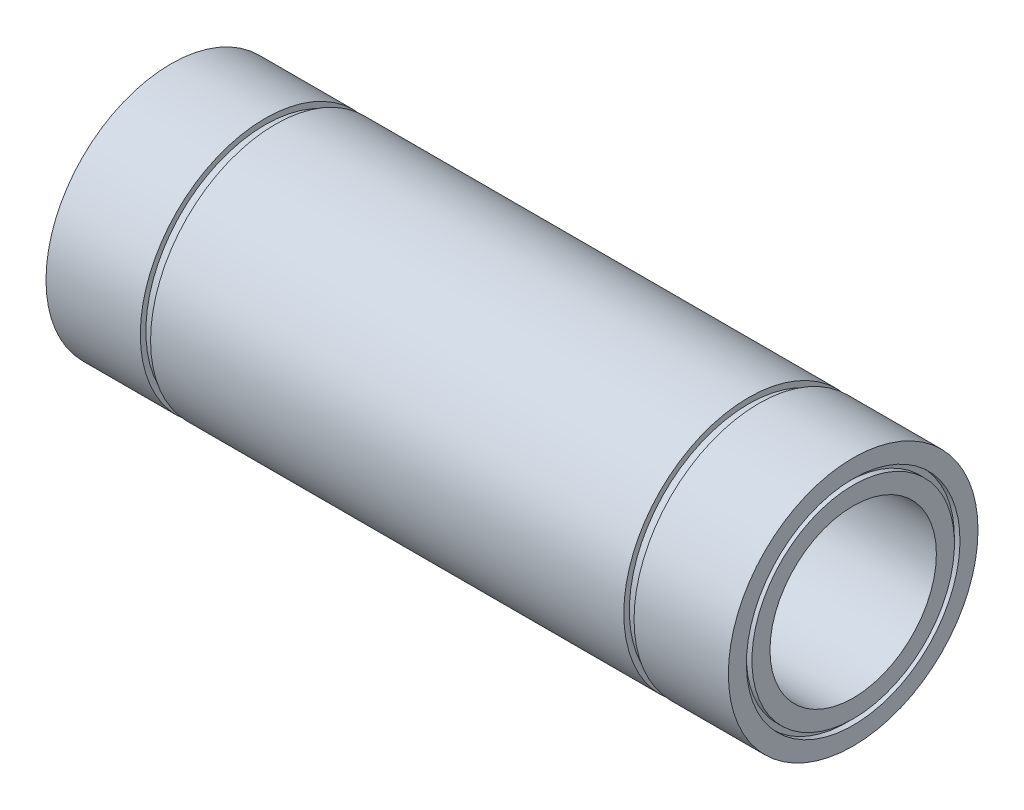
ISO-10303-21;
HEADER;
FILE_DESCRIPTION(('STEP AP214'),'2;1');
FILE_NAME('part.step','',(''),(''),'','','');
FILE_SCHEMA(('AUTOMOTIVE_DESIGN { 1 0 10303 214 1 1 1 1 }'));
ENDSEC;
DATA;
#1=APPLICATION_CONTEXT('core data for automotive mechanical design processes');
#2=APPLICATION_PROTOCOL_DEFINITION('international standard','automotive_design',2000,#1);
#3=PRODUCT_CONTEXT('',#1,'mechanical');
#4=PRODUCT('Part','Part','',(#3));
#5=PRODUCT_RELATED_PRODUCT_CATEGORY('part','',(#4));
#6=PRODUCT_DEFINITION_FORMATION('','',#4);
#7=PRODUCT_DEFINITION_CONTEXT('part definition',#1,'design');
#8=PRODUCT_DEFINITION('design','',#6,#7);
#9=PRODUCT_DEFINITION_SHAPE('','',#8);
#10=(LENGTH_UNIT() NAMED_UNIT(*) SI_UNIT(.MILLI.,.METRE.));
#11=(NAMED_UNIT(*) PLANE_ANGLE_UNIT() SI_UNIT($,.RADIAN.));
#12=(NAMED_UNIT(*) SI_UNIT($,.STERADIAN.) SOLID_ANGLE_UNIT());
#13=UNCERTAINTY_MEASURE_WITH_UNIT(LENGTH_MEASURE(1.E-05),#10,'distance_accuracy_value','');
#14=(GEOMETRIC_REPRESENTATION_CONTEXT(3) GLOBAL_UNCERTAINTY_ASSIGNED_CONTEXT((#13)) GLOBAL_UNIT_ASSIGNED_CONTEXT((#10,
#11,#12)) REPRESENTATION_CONTEXT('',''));
#15=CARTESIAN_POINT('',(0.,0.,0.));
#16=DIRECTION('',(0.,0.,1.));
#17=DIRECTION('',(1.,0.,0.));
#18=AXIS2_PLACEMENT_3D('',#15,#16,#17);
#19=CARTESIAN_POINT('',(-61.5,19.25,0.));
#20=DIRECTION('',(-1.,0.,0.));
#21=DIRECTION('',(0.,-1.,0.));
#22=AXIS2_PLACEMENT_3D('',#19,#20,#21);
#23=PLANE('',#22);
#24=CARTESIAN_POINT('',(-61.5,0.,0.));
#25=DIRECTION('',(1.,0.,0.));
#26=DIRECTION('',(0.,1.,0.));
#27=AXIS2_PLACEMENT_3D('',#24,#25,#26);
#28=CIRCLE('',#27,19.25);
#29=CARTESIAN_POINT('',(-61.5,19.25,0.));
#30=VERTEX_POINT('',#29);
#31=EDGE_CURVE('E123',#30,#30,#28,.T.);
#32=ORIENTED_EDGE('',*,*,#31,.T.);
#33=EDGE_LOOP('',(#32));
#34=FACE_BOUND('',#33,.T.);
#35=CARTESIAN_POINT('',(-61.5,0.,0.));
#36=DIRECTION('',(1.,0.,0.));
#37=DIRECTION('',(0.,1.,0.));
#38=AXIS2_PLACEMENT_3D('',#35,#36,#37);
#39=CIRCLE('',#38,22.5);
#40=CARTESIAN_POINT('',(-61.5,22.5,0.));
#41=VERTEX_POINT('',#40);
#42=EDGE_CURVE('E10',#41,#41,#39,.T.);
#43=ORIENTED_EDGE('',*,*,#42,.F.);
#44=EDGE_LOOP('',(#43));
#45=FACE_BOUND('',#44,.T.);
#46=ADVANCED_FACE('F40',(#34,#45),#23,.T.);
#47=CARTESIAN_POINT('',(0.,0.,0.));
#48=DIRECTION('',(1.,0.,0.));
#49=DIRECTION('',(0.,1.,0.));
#50=AXIS2_PLACEMENT_3D('',#47,#48,#49);
#51=CYLINDRICAL_SURFACE('',#50,22.5);
#52=ORIENTED_EDGE('',*,*,#42,.T.);
#53=EDGE_LOOP('',(#52));
#54=FACE_BOUND('',#53,.T.);
#55=CARTESIAN_POINT('',(-44.5,0.,0.));
#56=DIRECTION('',(1.,0.,0.));
#57=DIRECTION('',(0.,1.,0.));
#58=AXIS2_PLACEMENT_3D('',#55,#56,#57);
#59=CIRCLE('',#58,22.5);
#60=CARTESIAN_POINT('',(-44.5,22.5,0.));
#61=VERTEX_POINT('',#60);
#62=EDGE_CURVE('E47',#61,#61,#59,.T.);
#63=ORIENTED_EDGE('',*,*,#62,.F.);
#64=EDGE_LOOP('',(#63));
#65=FACE_BOUND('',#64,.T.);
#66=ADVANCED_FACE('F142',(#54,#65),#51,.T.);
#67=CARTESIAN_POINT('',(-44.5,22.5,0.));
#68=DIRECTION('',(1.,0.,0.));
#69=DIRECTION('',(0.,1.,0.));
#70=AXIS2_PLACEMENT_3D('',#67,#68,#69);
#71=PLANE('',#70);
#72=ORIENTED_EDGE('',*,*,#62,.T.);
#73=EDGE_LOOP('',(#72));
#74=FACE_BOUND('',#73,.T.);
#75=CARTESIAN_POINT('',(-44.5,0.,0.));
#76=DIRECTION('',(1.,0.,0.));
#77=DIRECTION('',(0.,1.,0.));
#78=AXIS2_PLACEMENT_3D('',#75,#76,#77);
#79=CIRCLE('',#78,21.5);
#80=CARTESIAN_POINT('',(-44.5,21.5,0.));
#81=VERTEX_POINT('',#80);
#82=EDGE_CURVE('E54',#81,#81,#79,.T.);
#83=ORIENTED_EDGE('',*,*,#82,.F.);
#84=EDGE_LOOP('',(#83));
#85=FACE_BOUND('',#84,.T.);
#86=ADVANCED_FACE('F146',(#74,#85),#71,.T.);
#87=CARTESIAN_POINT('',(0.,0.,0.));
#88=DIRECTION('',(1.,0.,0.));
#89=DIRECTION('',(0.,1.,0.));
#90=AXIS2_PLACEMENT_3D('',#87,#88,#89);
#91=CYLINDRICAL_SURFACE('',#90,21.5);
#92=ORIENTED_EDGE('',*,*,#82,.T.);
#93=EDGE_LOOP('',(#92));
#94=FACE_BOUND('',#93,.T.);
#95=CARTESIAN_POINT('',(-42.65,0.,0.));
#96=DIRECTION('',(1.,0.,0.));
#97=DIRECTION('',(0.,1.,0.));
#98=AXIS2_PLACEMENT_3D('',#95,#96,#97);
#99=CIRCLE('',#98,21.5);
#100=CARTESIAN_POINT('',(-42.65,21.5,0.));
#101=VERTEX_POINT('',#100);
#102=EDGE_CURVE('E60',#101,#101,#99,.T.);
#103=ORIENTED_EDGE('',*,*,#102,.F.);
#104=EDGE_LOOP('',(#103));
#105=FACE_BOUND('',#104,.T.);
#106=ADVANCED_FACE('F150',(#94,#105),#91,.T.);
#107=CARTESIAN_POINT('',(-42.65,21.5,0.));
#108=DIRECTION('',(-1.,0.,0.));
#109=DIRECTION('',(0.,-1.,0.));
#110=AXIS2_PLACEMENT_3D('',#107,#108,#109);
#111=PLANE('',#110);
#112=ORIENTED_EDGE('',*,*,#102,.T.);
#113=EDGE_LOOP('',(#112));
#114=FACE_BOUND('',#113,.T.);
#115=CARTESIAN_POINT('',(-42.65,0.,0.));
#116=DIRECTION('',(1.,0.,0.));
#117=DIRECTION('',(0.,1.,0.));
#118=AXIS2_PLACEMENT_3D('',#115,#116,#117);
#119=CIRCLE('',#118,22.5);
#120=CARTESIAN_POINT('',(-42.65,22.5,0.));
#121=VERTEX_POINT('',#120);
#122=EDGE_CURVE('E66',#121,#121,#119,.T.);
#123=ORIENTED_EDGE('',*,*,#122,.F.);
#124=EDGE_LOOP('',(#123));
#125=FACE_BOUND('',#124,.T.);
#126=ADVANCED_FACE('F156',(#114,#125),#111,.T.);
#127=CARTESIAN_POINT('',(0.,0.,0.));
#128=DIRECTION('',(1.,0.,0.));
#129=DIRECTION('',(0.,1.,0.));
#130=AXIS2_PLACEMENT_3D('',#127,#128,#129);
#131=CYLINDRICAL_SURFACE('',#130,22.5);
#132=ORIENTED_EDGE('',*,*,#122,.T.);
#133=EDGE_LOOP('',(#132));
#134=FACE_BOUND('',#133,.T.);
#135=CARTESIAN_POINT('',(42.65,0.,0.));
#136=DIRECTION('',(1.,0.,0.));
#137=DIRECTION('',(0.,1.,0.));
#138=AXIS2_PLACEMENT_3D('',#135,#136,#137);
#139=CIRCLE('',#138,22.5);
#140=CARTESIAN_POINT('',(42.65,22.5,0.));
#141=VERTEX_POINT('',#140);
#142=EDGE_CURVE('E70',#141,#141,#139,.T.);
#143=ORIENTED_EDGE('',*,*,#142,.F.);
#144=EDGE_LOOP('',(#143));
#145=FACE_BOUND('',#144,.T.);
#146=ADVANCED_FACE('F160',(#134,#145),#131,.T.);
#147=CARTESIAN_POINT('',(42.65,22.5,0.));
#148=DIRECTION('',(1.,0.,0.));
#149=DIRECTION('',(0.,1.,0.));
#150=AXIS2_PLACEMENT_3D('',#147,#148,#149);
#151=PLANE('',#150);
#152=ORIENTED_EDGE('',*,*,#142,.T.);
#153=EDGE_LOOP('',(#152));
#154=FACE_BOUND('',#153,.T.);
#155=CARTESIAN_POINT('',(42.65,0.,0.));
#156=DIRECTION('',(1.,0.,0.));
#157=DIRECTION('',(0.,1.,0.));
#158=AXIS2_PLACEMENT_3D('',#155,#156,#157);
#159=CIRCLE('',#158,21.5);
#160=CARTESIAN_POINT('',(42.65,21.5,0.));
#161=VERTEX_POINT('',#160);
#162=EDGE_CURVE('E74',#161,#161,#159,.T.);
#163=ORIENTED_EDGE('',*,*,#162,.F.);
#164=EDGE_LOOP('',(#163));
#165=FACE_BOUND('',#164,.T.);
#166=ADVANCED_FACE('F164',(#154,#165),#151,.T.);
#167=CARTESIAN_POINT('',(0.,0.,0.));
#168=DIRECTION('',(1.,0.,0.));
#169=DIRECTION('',(0.,1.,0.));
#170=AXIS2_PLACEMENT_3D('',#167,#168,#169);
#171=CYLINDRICAL_SURFACE('',#170,21.5);
#172=ORIENTED_EDGE('',*,*,#162,.T.);
#173=EDGE_LOOP('',(#172));
#174=FACE_BOUND('',#173,.T.);
#175=CARTESIAN_POINT('',(44.5,0.,0.));
#176=DIRECTION('',(1.,0.,0.));
#177=DIRECTION('',(0.,1.,0.));
#178=AXIS2_PLACEMENT_3D('',#175,#176,#177);
#179=CIRCLE('',#178,21.5);
#180=CARTESIAN_POINT('',(44.5,21.5,0.));
#181=VERTEX_POINT('',#180);
#182=EDGE_CURVE('E77',#181,#181,#179,.T.);
#183=ORIENTED_EDGE('',*,*,#182,.F.);
#184=EDGE_LOOP('',(#183));
#185=FACE_BOUND('',#184,.T.);
#186=ADVANCED_FACE('F168',(#174,#185),#171,.T.);
#187=CARTESIAN_POINT('',(44.5,21.5,0.));
#188=DIRECTION('',(-1.,0.,0.));
#189=DIRECTION('',(0.,-1.,0.));
#190=AXIS2_PLACEMENT_3D('',#187,#188,#189);
#191=PLANE('',#190);
#192=ORIENTED_EDGE('',*,*,#182,.T.);
#193=EDGE_LOOP('',(#192));
#194=FACE_BOUND('',#193,.T.);
#195=CARTESIAN_POINT('',(44.5,0.,0.));
#196=DIRECTION('',(1.,0.,0.));
#197=DIRECTION('',(0.,1.,0.));
#198=AXIS2_PLACEMENT_3D('',#195,#196,#197);
#199=CIRCLE('',#198,22.5);
#200=CARTESIAN_POINT('',(44.5,22.5,0.));
#201=VERTEX_POINT('',#200);
#202=EDGE_CURVE('E81',#201,#201,#199,.T.);
#203=ORIENTED_EDGE('',*,*,#202,.F.);
#204=EDGE_LOOP('',(#203));
#205=FACE_BOUND('',#204,.T.);
#206=ADVANCED_FACE('F172',(#194,#205),#191,.T.);
#207=CARTESIAN_POINT('',(0.,0.,0.));
#208=DIRECTION('',(1.,0.,0.));
#209=DIRECTION('',(0.,1.,0.));
#210=AXIS2_PLACEMENT_3D('',#207,#208,#209);
#211=CYLINDRICAL_SURFACE('',#210,22.5);
#212=ORIENTED_EDGE('',*,*,#202,.T.);
#213=EDGE_LOOP('',(#212));
#214=FACE_BOUND('',#213,.T.);
#215=CARTESIAN_POINT('',(61.5,0.,0.));
#216=DIRECTION('',(1.,0.,0.));
#217=DIRECTION('',(0.,1.,0.));
#218=AXIS2_PLACEMENT_3D('',#215,#216,#217);
#219=CIRCLE('',#218,22.4999999999999);
#220=CARTESIAN_POINT('',(61.5,22.4999999999999,0.));
#221=VERTEX_POINT('',#220);
#222=EDGE_CURVE('E85',#221,#221,#219,.T.);
#223=ORIENTED_EDGE('',*,*,#222,.F.);
#224=EDGE_LOOP('',(#223));
#225=FACE_BOUND('',#224,.T.);
#226=ADVANCED_FACE('F176',(#214,#225),#211,.T.);
#227=CARTESIAN_POINT('',(61.5,22.4999999999999,0.));
#228=DIRECTION('',(1.,0.,0.));
#229=DIRECTION('',(0.,1.,0.));
#230=AXIS2_PLACEMENT_3D('',#227,#228,#229);
#231=PLANE('',#230);
#232=ORIENTED_EDGE('',*,*,#222,.T.);
#233=EDGE_LOOP('',(#232));
#234=FACE_BOUND('',#233,.T.);
#235=CARTESIAN_POINT('',(61.5,0.,0.));
#236=DIRECTION('',(1.,0.,0.));
#237=DIRECTION('',(0.,1.,0.));
#238=AXIS2_PLACEMENT_3D('',#235,#236,#237);
#239=CIRCLE('',#238,19.25);
#240=CARTESIAN_POINT('',(61.5,19.25,0.));
#241=VERTEX_POINT('',#240);
#242=EDGE_CURVE('E89',#241,#241,#239,.T.);
#243=ORIENTED_EDGE('',*,*,#242,.F.);
#244=EDGE_LOOP('',(#243));
#245=FACE_BOUND('',#244,.T.);
#246=ADVANCED_FACE('F180',(#234,#245),#231,.T.);
#247=CARTESIAN_POINT('',(0.,0.,0.));
#248=DIRECTION('',(1.,0.,0.));
#249=DIRECTION('',(0.,1.,0.));
#250=AXIS2_PLACEMENT_3D('',#247,#248,#249);
#251=CYLINDRICAL_SURFACE('',#250,19.25);
#252=ORIENTED_EDGE('',*,*,#242,.T.);
#253=EDGE_LOOP('',(#252));
#254=FACE_BOUND('',#253,.T.);
#255=CARTESIAN_POINT('',(60.5,0.,0.));
#256=DIRECTION('',(1.,0.,0.));
#257=DIRECTION('',(0.,1.,0.));
#258=AXIS2_PLACEMENT_3D('',#255,#256,#257);
#259=CIRCLE('',#258,19.25);
#260=CARTESIAN_POINT('',(60.5,19.25,0.));
#261=VERTEX_POINT('',#260);
#262=EDGE_CURVE('E93',#261,#261,#259,.T.);
#263=ORIENTED_EDGE('',*,*,#262,.F.);
#264=EDGE_LOOP('',(#263));
#265=FACE_BOUND('',#264,.T.);
#266=ADVANCED_FACE('F184',(#254,#265),#251,.F.);
#267=CARTESIAN_POINT('',(60.5,19.25,0.));
#268=DIRECTION('',(1.,0.,0.));
#269=DIRECTION('',(0.,1.,0.));
#270=AXIS2_PLACEMENT_3D('',#267,#268,#269);
#271=PLANE('',#270);
#272=ORIENTED_EDGE('',*,*,#262,.T.);
#273=EDGE_LOOP('',(#272));
#274=FACE_BOUND('',#273,.T.);
#275=CARTESIAN_POINT('',(60.5,0.,0.));
#276=DIRECTION('',(1.,0.,0.));
#277=DIRECTION('',(0.,1.,0.));
#278=AXIS2_PLACEMENT_3D('',#275,#276,#277);
#279=CIRCLE('',#278,18.25);
#280=CARTESIAN_POINT('',(60.5,18.25,0.));
#281=VERTEX_POINT('',#280);
#282=EDGE_CURVE('E97',#281,#281,#279,.T.);
#283=ORIENTED_EDGE('',*,*,#282,.F.);
#284=EDGE_LOOP('',(#283));
#285=FACE_BOUND('',#284,.T.);
#286=ADVANCED_FACE('F188',(#274,#285),#271,.T.);
#287=CARTESIAN_POINT('',(0.,0.,0.));
#288=DIRECTION('',(1.,0.,0.));
#289=DIRECTION('',(0.,1.,0.));
#290=AXIS2_PLACEMENT_3D('',#287,#288,#289);
#291=CYLINDRICAL_SURFACE('',#290,18.25);
#292=ORIENTED_EDGE('',*,*,#282,.T.);
#293=EDGE_LOOP('',(#292));
#294=FACE_BOUND('',#293,.T.);
#295=CARTESIAN_POINT('',(61.5,0.,0.));
#296=DIRECTION('',(1.,0.,0.));
#297=DIRECTION('',(0.,1.,0.));
#298=AXIS2_PLACEMENT_3D('',#295,#296,#297);
#299=CIRCLE('',#298,18.25);
#300=CARTESIAN_POINT('',(61.5,18.25,0.));
#301=VERTEX_POINT('',#300);
#302=EDGE_CURVE('E100',#301,#301,#299,.T.);
#303=ORIENTED_EDGE('',*,*,#302,.F.);
#304=EDGE_LOOP('',(#303));
#305=FACE_BOUND('',#304,.T.);
#306=ADVANCED_FACE('F192',(#294,#305),#291,.T.);
#307=CARTESIAN_POINT('',(61.5,18.25,0.));
#308=DIRECTION('',(1.,0.,0.));
#309=DIRECTION('',(0.,1.,0.));
#310=AXIS2_PLACEMENT_3D('',#307,#308,#309);
#311=PLANE('',#310);
#312=ORIENTED_EDGE('',*,*,#302,.T.);
#313=EDGE_LOOP('',(#312));
#314=FACE_BOUND('',#313,.T.);
#315=CARTESIAN_POINT('',(61.5,0.,0.));
#316=DIRECTION('',(1.,0.,0.));
#317=DIRECTION('',(0.,1.,0.));
#318=AXIS2_PLACEMENT_3D('',#315,#316,#317);
#319=CIRCLE('',#318,15.);
#320=CARTESIAN_POINT('',(61.5,15.,0.));
#321=VERTEX_POINT('',#320);
#322=EDGE_CURVE('E104',#321,#321,#319,.T.);
#323=ORIENTED_EDGE('',*,*,#322,.F.);
#324=EDGE_LOOP('',(#323));
#325=FACE_BOUND('',#324,.T.);
#326=ADVANCED_FACE('F196',(#314,#325),#311,.T.);
#327=CARTESIAN_POINT('',(0.,0.,0.));
#328=DIRECTION('',(1.,0.,0.));
#329=DIRECTION('',(0.,1.,0.));
#330=AXIS2_PLACEMENT_3D('',#327,#328,#329);
#331=CYLINDRICAL_SURFACE('',#330,15.);
#332=ORIENTED_EDGE('',*,*,#322,.T.);
#333=EDGE_LOOP('',(#332));
#334=FACE_BOUND('',#333,.T.);
#335=CARTESIAN_POINT('',(-61.5,0.,0.));
#336=DIRECTION('',(1.,0.,0.));
#337=DIRECTION('',(0.,1.,0.));
#338=AXIS2_PLACEMENT_3D('',#335,#336,#337);
#339=CIRCLE('',#338,15.);
#340=CARTESIAN_POINT('',(-61.5,15.,0.));
#341=VERTEX_POINT('',#340);
#342=EDGE_CURVE('E108',#341,#341,#339,.T.);
#343=ORIENTED_EDGE('',*,*,#342,.F.);
#344=EDGE_LOOP('',(#343));
#345=FACE_BOUND('',#344,.T.);
#346=ADVANCED_FACE('F200',(#334,#345),#331,.F.);
#347=CARTESIAN_POINT('',(-61.5,15.,0.));
#348=DIRECTION('',(-1.,0.,0.));
#349=DIRECTION('',(0.,-1.,0.));
#350=AXIS2_PLACEMENT_3D('',#347,#348,#349);
#351=PLANE('',#350);
#352=ORIENTED_EDGE('',*,*,#342,.T.);
#353=EDGE_LOOP('',(#352));
#354=FACE_BOUND('',#353,.T.);
#355=CARTESIAN_POINT('',(-61.5,0.,0.));
#356=DIRECTION('',(1.,0.,0.));
#357=DIRECTION('',(0.,1.,0.));
#358=AXIS2_PLACEMENT_3D('',#355,#356,#357);
#359=CIRCLE('',#358,18.25);
#360=CARTESIAN_POINT('',(-61.5,18.25,0.));
#361=VERTEX_POINT('',#360);
#362=EDGE_CURVE('E112',#361,#361,#359,.T.);
#363=ORIENTED_EDGE('',*,*,#362,.F.);
#364=EDGE_LOOP('',(#363));
#365=FACE_BOUND('',#364,.T.);
#366=ADVANCED_FACE('F204',(#354,#365),#351,.T.);
#367=CARTESIAN_POINT('',(0.,0.,0.));
#368=DIRECTION('',(1.,0.,0.));
#369=DIRECTION('',(0.,1.,0.));
#370=AXIS2_PLACEMENT_3D('',#367,#368,#369);
#371=CYLINDRICAL_SURFACE('',#370,18.25);
#372=ORIENTED_EDGE('',*,*,#362,.T.);
#373=EDGE_LOOP('',(#372));
#374=FACE_BOUND('',#373,.T.);
#375=CARTESIAN_POINT('',(-60.5,0.,0.));
#376=DIRECTION('',(1.,0.,0.));
#377=DIRECTION('',(0.,1.,0.));
#378=AXIS2_PLACEMENT_3D('',#375,#376,#377);
#379=CIRCLE('',#378,18.25);
#380=CARTESIAN_POINT('',(-60.5,18.25,0.));
#381=VERTEX_POINT('',#380);
#382=EDGE_CURVE('E116',#381,#381,#379,.T.);
#383=ORIENTED_EDGE('',*,*,#382,.F.);
#384=EDGE_LOOP('',(#383));
#385=FACE_BOUND('',#384,.T.);
#386=ADVANCED_FACE('F138',(#374,#385),#371,.T.);
#387=CARTESIAN_POINT('',(-60.5,19.25,0.));
#388=DIRECTION('',(-1.,0.,0.));
#389=DIRECTION('',(0.,-1.,0.));
#390=AXIS2_PLACEMENT_3D('',#387,#388,#389);
#391=PLANE('',#390);
#392=ORIENTED_EDGE('',*,*,#382,.T.);
#393=EDGE_LOOP('',(#392));
#394=FACE_BOUND('',#393,.T.);
#395=CARTESIAN_POINT('',(-60.5,0.,0.));
#396=DIRECTION('',(1.,0.,0.));
#397=DIRECTION('',(0.,1.,0.));
#398=AXIS2_PLACEMENT_3D('',#395,#396,#397);
#399=CIRCLE('',#398,19.25);
#400=CARTESIAN_POINT('',(-60.5,19.25,0.));
#401=VERTEX_POINT('',#400);
#402=EDGE_CURVE('E120',#401,#401,#399,.T.);
#403=ORIENTED_EDGE('',*,*,#402,.F.);
#404=EDGE_LOOP('',(#403));
#405=FACE_BOUND('',#404,.T.);
#406=ADVANCED_FACE('F132',(#394,#405),#391,.T.);
#407=CARTESIAN_POINT('',(0.,0.,0.));
#408=DIRECTION('',(1.,0.,0.));
#409=DIRECTION('',(0.,1.,0.));
#410=AXIS2_PLACEMENT_3D('',#407,#408,#409);
#411=CYLINDRICAL_SURFACE('',#410,19.25);
#412=ORIENTED_EDGE('',*,*,#402,.T.);
#413=EDGE_LOOP('',(#412));
#414=FACE_BOUND('',#413,.T.);
#415=ORIENTED_EDGE('',*,*,#31,.F.);
#416=EDGE_LOOP('',(#415));
#417=FACE_BOUND('',#416,.T.);
#418=ADVANCED_FACE('F130',(#414,#417),#411,.F.);
#419=CLOSED_SHELL('',(#46,#66,#86,#106,#126,#146,#166,#186,#206,#226,#246,#266,#286,#306,#326,
#346,#366,#386,#406,#418));
#420=MANIFOLD_SOLID_BREP('B2',#419);
#421=ADVANCED_BREP_SHAPE_REPRESENTATION('',(#18,#420),#14);
#422=SHAPE_DEFINITION_REPRESENTATION(#9,#421);
ENDSEC;
END-ISO-10303-21;
